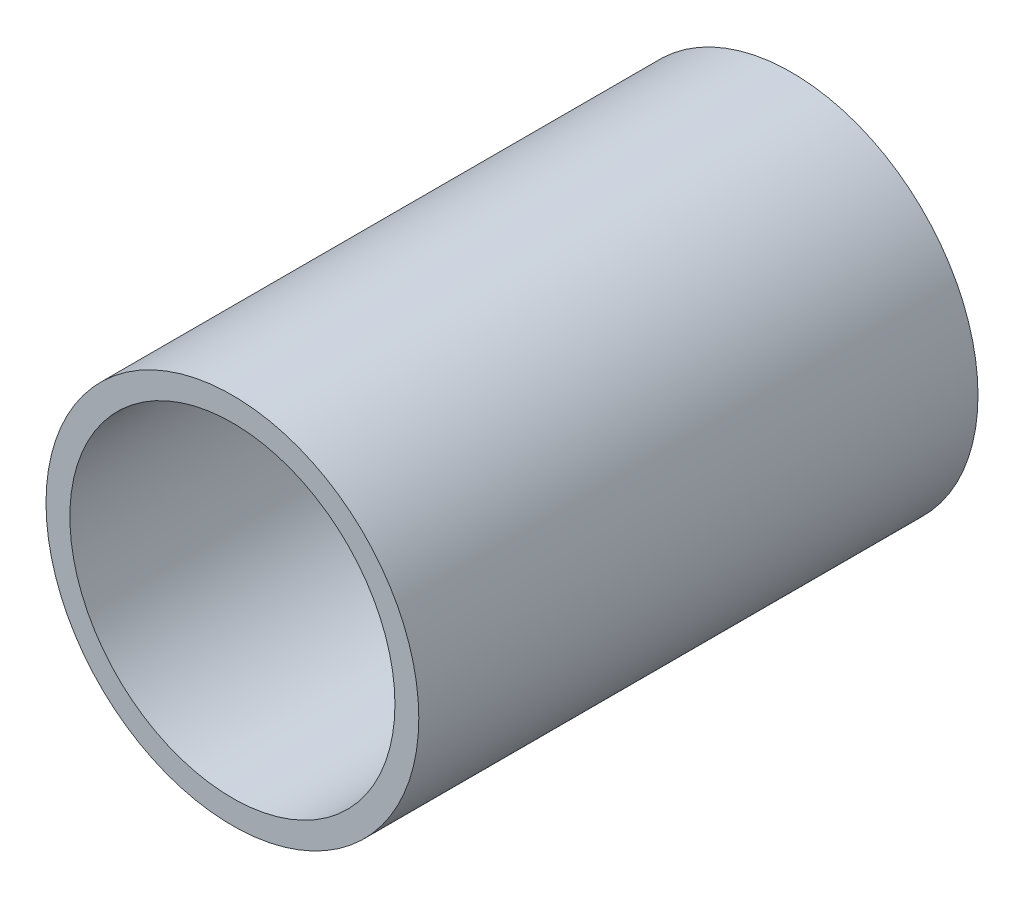
ISO-10303-21;
HEADER;
FILE_DESCRIPTION(('STEP AP214'),'2;1');
FILE_NAME('part.step','',(''),(''),'','','');
FILE_SCHEMA(('AUTOMOTIVE_DESIGN { 1 0 10303 214 1 1 1 1 }'));
ENDSEC;
DATA;
#1=APPLICATION_CONTEXT('core data for automotive mechanical design processes');
#2=APPLICATION_PROTOCOL_DEFINITION('international standard','automotive_design',2000,#1);
#3=PRODUCT_CONTEXT('',#1,'mechanical');
#4=PRODUCT('Part','Part','',(#3));
#5=PRODUCT_RELATED_PRODUCT_CATEGORY('part','',(#4));
#6=PRODUCT_DEFINITION_FORMATION('','',#4);
#7=PRODUCT_DEFINITION_CONTEXT('part definition',#1,'design');
#8=PRODUCT_DEFINITION('design','',#6,#7);
#9=PRODUCT_DEFINITION_SHAPE('','',#8);
#10=(LENGTH_UNIT() NAMED_UNIT(*) SI_UNIT(.MILLI.,.METRE.));
#11=(NAMED_UNIT(*) PLANE_ANGLE_UNIT() SI_UNIT($,.RADIAN.));
#12=(NAMED_UNIT(*) SI_UNIT($,.STERADIAN.) SOLID_ANGLE_UNIT());
#13=UNCERTAINTY_MEASURE_WITH_UNIT(LENGTH_MEASURE(1.E-05),#10,'distance_accuracy_value','');
#14=(GEOMETRIC_REPRESENTATION_CONTEXT(3) GLOBAL_UNCERTAINTY_ASSIGNED_CONTEXT((#13)) GLOBAL_UNIT_ASSIGNED_CONTEXT((#10,
#11,#12)) REPRESENTATION_CONTEXT('',''));
#15=CARTESIAN_POINT('',(0.,0.,0.));
#16=DIRECTION('',(0.,0.,1.));
#17=DIRECTION('',(1.,0.,0.));
#18=AXIS2_PLACEMENT_3D('',#15,#16,#17);
#19=CARTESIAN_POINT('',(0.,0.,9.525));
#20=DIRECTION('',(0.,0.,1.));
#21=DIRECTION('',(1.,0.,0.));
#22=AXIS2_PLACEMENT_3D('',#19,#20,#21);
#23=PLANE('',#22);
#24=CARTESIAN_POINT('',(0.,0.,9.525));
#25=DIRECTION('',(0.,0.,1.));
#26=DIRECTION('',(1.,0.,0.));
#27=AXIS2_PLACEMENT_3D('',#24,#25,#26);
#28=CIRCLE('',#27,6.35);
#29=CARTESIAN_POINT('',(6.35,0.,9.525));
#30=VERTEX_POINT('',#29);
#31=EDGE_CURVE('E10',#30,#30,#28,.T.);
#32=ORIENTED_EDGE('',*,*,#31,.T.);
#33=EDGE_LOOP('',(#32));
#34=FACE_BOUND('',#33,.T.);
#35=CARTESIAN_POINT('',(0.,0.,9.525));
#36=DIRECTION('',(0.,0.,1.));
#37=DIRECTION('',(1.,0.,0.));
#38=AXIS2_PLACEMENT_3D('',#35,#36,#37);
#39=CIRCLE('',#38,5.5372);
#40=CARTESIAN_POINT('',(5.5372,0.,9.525));
#41=VERTEX_POINT('',#40);
#42=EDGE_CURVE('E50',#41,#41,#39,.T.);
#43=ORIENTED_EDGE('',*,*,#42,.F.);
#44=EDGE_LOOP('',(#43));
#45=FACE_BOUND('',#44,.T.);
#46=ADVANCED_FACE('F37',(#34,#45),#23,.T.);
#47=CARTESIAN_POINT('',(0.,0.,-9.525));
#48=DIRECTION('',(0.,0.,1.));
#49=DIRECTION('',(1.,0.,0.));
#50=AXIS2_PLACEMENT_3D('',#47,#48,#49);
#51=PLANE('',#50);
#52=CARTESIAN_POINT('',(0.,0.,-9.525));
#53=DIRECTION('',(0.,0.,1.));
#54=DIRECTION('',(1.,0.,0.));
#55=AXIS2_PLACEMENT_3D('',#52,#53,#54);
#56=CIRCLE('',#55,6.35);
#57=CARTESIAN_POINT('',(6.35,0.,-9.525));
#58=VERTEX_POINT('',#57);
#59=EDGE_CURVE('E41',#58,#58,#56,.T.);
#60=ORIENTED_EDGE('',*,*,#59,.F.);
#61=EDGE_LOOP('',(#60));
#62=FACE_BOUND('',#61,.T.);
#63=CARTESIAN_POINT('',(0.,0.,-9.525));
#64=DIRECTION('',(0.,0.,1.));
#65=DIRECTION('',(1.,0.,0.));
#66=AXIS2_PLACEMENT_3D('',#63,#64,#65);
#67=CIRCLE('',#66,5.5372);
#68=CARTESIAN_POINT('',(5.5372,0.,-9.525));
#69=VERTEX_POINT('',#68);
#70=EDGE_CURVE('E52',#69,#69,#67,.T.);
#71=ORIENTED_EDGE('',*,*,#70,.T.);
#72=EDGE_LOOP('',(#71));
#73=FACE_BOUND('',#72,.T.);
#74=ADVANCED_FACE('F64',(#62,#73),#51,.F.);
#75=CARTESIAN_POINT('',(0.,0.,9.525));
#76=DIRECTION('',(0.,0.,-1.));
#77=DIRECTION('',(-1.,0.,0.));
#78=AXIS2_PLACEMENT_3D('',#75,#76,#77);
#79=CYLINDRICAL_SURFACE('',#78,6.35);
#80=ORIENTED_EDGE('',*,*,#31,.F.);
#81=EDGE_LOOP('',(#80));
#82=FACE_BOUND('',#81,.T.);
#83=ORIENTED_EDGE('',*,*,#59,.T.);
#84=EDGE_LOOP('',(#83));
#85=FACE_BOUND('',#84,.T.);
#86=ADVANCED_FACE('F39',(#82,#85),#79,.T.);
#87=CARTESIAN_POINT('',(0.,0.,9.525));
#88=DIRECTION('',(0.,0.,-1.));
#89=DIRECTION('',(-1.,0.,0.));
#90=AXIS2_PLACEMENT_3D('',#87,#88,#89);
#91=CYLINDRICAL_SURFACE('',#90,5.5372);
#92=ORIENTED_EDGE('',*,*,#42,.T.);
#93=EDGE_LOOP('',(#92));
#94=FACE_BOUND('',#93,.T.);
#95=ORIENTED_EDGE('',*,*,#70,.F.);
#96=EDGE_LOOP('',(#95));
#97=FACE_BOUND('',#96,.T.);
#98=ADVANCED_FACE('F60',(#94,#97),#91,.F.);
#99=CLOSED_SHELL('',(#46,#74,#86,#98));
#100=MANIFOLD_SOLID_BREP('B2',#99);
#101=ADVANCED_BREP_SHAPE_REPRESENTATION('',(#18,#100),#14);
#102=SHAPE_DEFINITION_REPRESENTATION(#9,#101);
ENDSEC;
END-ISO-10303-21;
